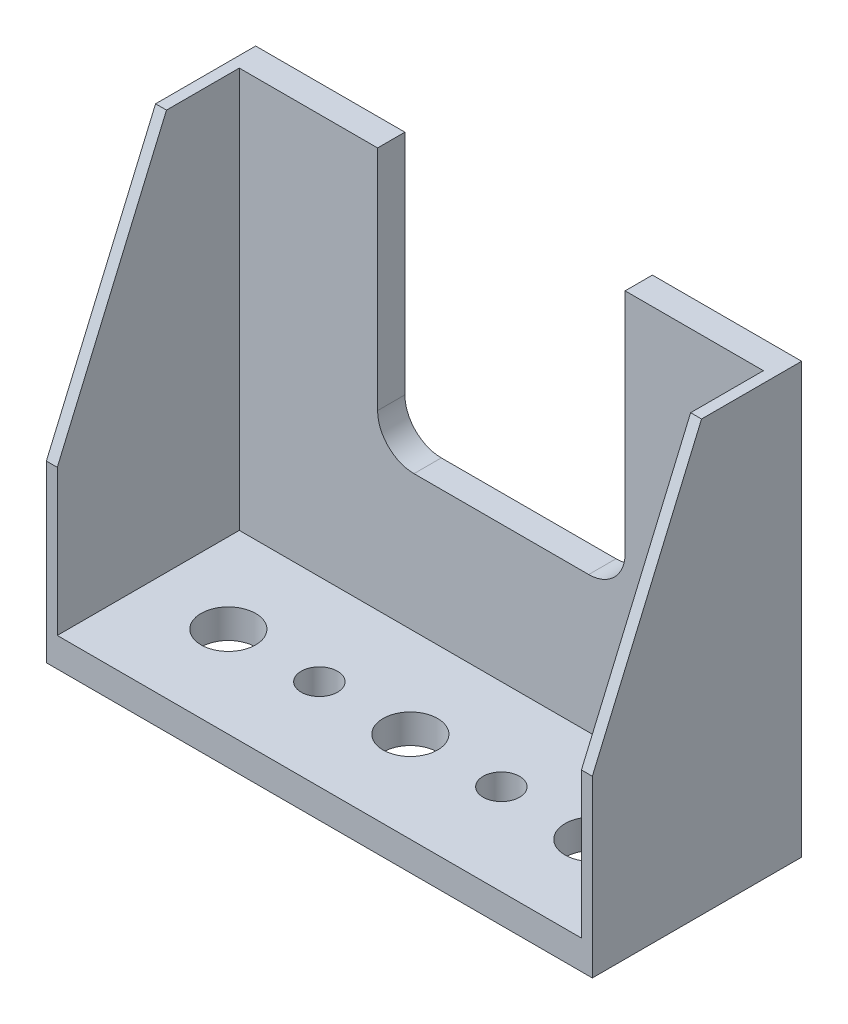
ISO-10303-21;
HEADER;
FILE_DESCRIPTION(('STEP AP214'),'2;1');
FILE_NAME('part.step','',(''),(''),'','','');
FILE_SCHEMA(('AUTOMOTIVE_DESIGN { 1 0 10303 214 1 1 1 1 }'));
ENDSEC;
DATA;
#1=APPLICATION_CONTEXT('core data for automotive mechanical design processes');
#2=APPLICATION_PROTOCOL_DEFINITION('international standard','automotive_design',2000,#1);
#3=PRODUCT_CONTEXT('',#1,'mechanical');
#4=PRODUCT('Part','Part','',(#3));
#5=PRODUCT_RELATED_PRODUCT_CATEGORY('part','',(#4));
#6=PRODUCT_DEFINITION_FORMATION('','',#4);
#7=PRODUCT_DEFINITION_CONTEXT('part definition',#1,'design');
#8=PRODUCT_DEFINITION('design','',#6,#7);
#9=PRODUCT_DEFINITION_SHAPE('','',#8);
#10=(LENGTH_UNIT() NAMED_UNIT(*) SI_UNIT(.MILLI.,.METRE.));
#11=(NAMED_UNIT(*) PLANE_ANGLE_UNIT() SI_UNIT($,.RADIAN.));
#12=(NAMED_UNIT(*) SI_UNIT($,.STERADIAN.) SOLID_ANGLE_UNIT());
#13=UNCERTAINTY_MEASURE_WITH_UNIT(LENGTH_MEASURE(1.E-05),#10,'distance_accuracy_value','');
#14=(GEOMETRIC_REPRESENTATION_CONTEXT(3) GLOBAL_UNCERTAINTY_ASSIGNED_CONTEXT((#13)) GLOBAL_UNIT_ASSIGNED_CONTEXT((#10,
#11,#12)) REPRESENTATION_CONTEXT('',''));
#15=CARTESIAN_POINT('',(0.,0.,0.));
#16=DIRECTION('',(0.,0.,1.));
#17=DIRECTION('',(1.,0.,0.));
#18=AXIS2_PLACEMENT_3D('',#15,#16,#17);
#19=CARTESIAN_POINT('',(-15.,11.,1.5));
#20=DIRECTION('',(0.,-1.,0.));
#21=DIRECTION('',(0.,0.,-1.));
#22=AXIS2_PLACEMENT_3D('',#19,#20,#21);
#23=PLANE('',#22);
#24=DIRECTION('',(-1.,0.,0.));
#25=VECTOR('',#24,1.);
#26=CARTESIAN_POINT('',(-15.,11.,1.5));
#27=LINE('',#26,#25);
#28=CARTESIAN_POINT('',(-6.8,11.,1.5));
#29=VERTEX_POINT('',#28);
#30=CARTESIAN_POINT('',(-14.4,11.,1.5));
#31=VERTEX_POINT('',#30);
#32=EDGE_CURVE('E177',#29,#31,#27,.T.);
#33=ORIENTED_EDGE('',*,*,#32,.F.);
#34=DIRECTION('',(0.,0.,1.));
#35=VECTOR('',#34,1.);
#36=CARTESIAN_POINT('',(-6.8,11.,-0.1));
#37=LINE('',#36,#35);
#38=CARTESIAN_POINT('',(-6.8,11.,0.));
#39=VERTEX_POINT('',#38);
#40=EDGE_CURVE('E169',#39,#29,#37,.T.);
#41=ORIENTED_EDGE('',*,*,#40,.F.);
#42=DIRECTION('',(-1.,0.,0.));
#43=VECTOR('',#42,1.);
#44=CARTESIAN_POINT('',(-15.,11.,0.));
#45=LINE('',#44,#43);
#46=CARTESIAN_POINT('',(-15.,11.,0.));
#47=VERTEX_POINT('',#46);
#48=EDGE_CURVE('E192',#39,#47,#45,.T.);
#49=ORIENTED_EDGE('',*,*,#48,.T.);
#50=DIRECTION('',(0.,0.,-1.));
#51=VECTOR('',#50,1.);
#52=CARTESIAN_POINT('',(-15.,11.,1.5));
#53=LINE('',#52,#51);
#54=CARTESIAN_POINT('',(-15.,11.,5.5));
#55=VERTEX_POINT('',#54);
#56=EDGE_CURVE('E176',#55,#47,#53,.T.);
#57=ORIENTED_EDGE('',*,*,#56,.F.);
#58=DIRECTION('',(1.,0.,0.));
#59=VECTOR('',#58,1.);
#60=CARTESIAN_POINT('',(-63.6738186810938,11.,5.5));
#61=LINE('',#60,#59);
#62=CARTESIAN_POINT('',(-14.4,11.,5.5));
#63=VERTEX_POINT('',#62);
#64=EDGE_CURVE('E253',#55,#63,#61,.T.);
#65=ORIENTED_EDGE('',*,*,#64,.T.);
#66=DIRECTION('',(0.,0.,-1.));
#67=VECTOR('',#66,1.);
#68=CARTESIAN_POINT('',(-14.4,11.,11.5));
#69=LINE('',#68,#67);
#70=EDGE_CURVE('E280',#63,#31,#69,.T.);
#71=ORIENTED_EDGE('',*,*,#70,.T.);
#72=EDGE_LOOP('',(#33,#41,#49,#57,#65,#71));
#73=FACE_BOUND('',#72,.T.);
#74=ADVANCED_FACE('F38',(#73),#23,.F.);
#75=CARTESIAN_POINT('',(-15.,11.,1.5));
#76=DIRECTION('',(1.,0.,0.));
#77=DIRECTION('',(0.,1.,0.));
#78=AXIS2_PLACEMENT_3D('',#75,#76,#77);
#79=PLANE('',#78);
#80=DIRECTION('',(0.,-0.919145030018058,0.393919298579168));
#81=VECTOR('',#80,1.);
#82=CARTESIAN_POINT('',(-15.,12.448275862069,4.87931034482759));
#83=LINE('',#82,#81);
#84=CARTESIAN_POINT('',(-15.,-3.,11.5));
#85=VERTEX_POINT('',#84);
#86=EDGE_CURVE('E261',#55,#85,#83,.T.);
#87=ORIENTED_EDGE('',*,*,#86,.F.);
#88=ORIENTED_EDGE('',*,*,#56,.T.);
#89=DIRECTION('',(0.,-1.,0.));
#90=VECTOR('',#89,1.);
#91=CARTESIAN_POINT('',(-15.,11.,0.));
#92=LINE('',#91,#90);
#93=CARTESIAN_POINT('',(-15.,-12.6,0.));
#94=VERTEX_POINT('',#93);
#95=EDGE_CURVE('E186',#47,#94,#92,.T.);
#96=ORIENTED_EDGE('',*,*,#95,.T.);
#97=DIRECTION('',(0.,0.,-1.));
#98=VECTOR('',#97,1.);
#99=CARTESIAN_POINT('',(-15.,-12.6,11.5));
#100=LINE('',#99,#98);
#101=CARTESIAN_POINT('',(-15.,-12.6,11.5));
#102=VERTEX_POINT('',#101);
#103=EDGE_CURVE('E235',#102,#94,#100,.T.);
#104=ORIENTED_EDGE('',*,*,#103,.F.);
#105=DIRECTION('',(0.,-1.,0.));
#106=VECTOR('',#105,1.);
#107=CARTESIAN_POINT('',(-15.,11.,11.5));
#108=LINE('',#107,#106);
#109=EDGE_CURVE('E275',#85,#102,#108,.T.);
#110=ORIENTED_EDGE('',*,*,#109,.F.);
#111=EDGE_LOOP('',(#87,#88,#96,#104,#110));
#112=FACE_BOUND('',#111,.T.);
#113=ADVANCED_FACE('F312',(#112),#79,.F.);
#114=CARTESIAN_POINT('',(15.,11.,1.5));
#115=DIRECTION('',(-1.,0.,0.));
#116=DIRECTION('',(0.,-1.,0.));
#117=AXIS2_PLACEMENT_3D('',#114,#115,#116);
#118=PLANE('',#117);
#119=DIRECTION('',(0.,0.919145030018058,-0.393919298579168));
#120=VECTOR('',#119,1.);
#121=CARTESIAN_POINT('',(15.,12.448275862069,4.87931034482759));
#122=LINE('',#121,#120);
#123=CARTESIAN_POINT('',(15.,-2.99999999999999,11.5));
#124=VERTEX_POINT('',#123);
#125=CARTESIAN_POINT('',(15.,11.,5.5));
#126=VERTEX_POINT('',#125);
#127=EDGE_CURVE('E259',#124,#126,#122,.T.);
#128=ORIENTED_EDGE('',*,*,#127,.F.);
#129=DIRECTION('',(0.,-1.,0.));
#130=VECTOR('',#129,1.);
#131=CARTESIAN_POINT('',(15.,11.,11.5));
#132=LINE('',#131,#130);
#133=CARTESIAN_POINT('',(15.,-12.6,11.5));
#134=VERTEX_POINT('',#133);
#135=EDGE_CURVE('E264',#124,#134,#132,.T.);
#136=ORIENTED_EDGE('',*,*,#135,.T.);
#137=DIRECTION('',(0.,0.,1.));
#138=VECTOR('',#137,1.);
#139=CARTESIAN_POINT('',(15.,-12.6,11.5));
#140=LINE('',#139,#138);
#141=CARTESIAN_POINT('',(15.,-12.6,0.));
#142=VERTEX_POINT('',#141);
#143=EDGE_CURVE('E241',#142,#134,#140,.T.);
#144=ORIENTED_EDGE('',*,*,#143,.F.);
#145=DIRECTION('',(0.,1.,0.));
#146=VECTOR('',#145,1.);
#147=CARTESIAN_POINT('',(15.,11.,0.));
#148=LINE('',#147,#146);
#149=CARTESIAN_POINT('',(15.,11.,0.));
#150=VERTEX_POINT('',#149);
#151=EDGE_CURVE('E188',#142,#150,#148,.T.);
#152=ORIENTED_EDGE('',*,*,#151,.T.);
#153=DIRECTION('',(0.,0.,-1.));
#154=VECTOR('',#153,1.);
#155=CARTESIAN_POINT('',(15.,11.,1.5));
#156=LINE('',#155,#154);
#157=EDGE_CURVE('E180',#126,#150,#156,.T.);
#158=ORIENTED_EDGE('',*,*,#157,.F.);
#159=EDGE_LOOP('',(#128,#136,#144,#152,#158));
#160=FACE_BOUND('',#159,.T.);
#161=ADVANCED_FACE('F320',(#160),#118,.F.);
#162=CARTESIAN_POINT('',(-14.4,11.,11.5));
#163=DIRECTION('',(-1.,0.,0.));
#164=DIRECTION('',(0.,-1.,0.));
#165=AXIS2_PLACEMENT_3D('',#162,#163,#164);
#166=PLANE('',#165);
#167=DIRECTION('',(0.,0.919145030018058,-0.393919298579168));
#168=VECTOR('',#167,1.);
#169=CARTESIAN_POINT('',(-14.4,8.82758620689655,6.43103448275862));
#170=LINE('',#169,#168);
#171=CARTESIAN_POINT('',(-14.4,-3.,11.5));
#172=VERTEX_POINT('',#171);
#173=EDGE_CURVE('E256',#172,#63,#170,.T.);
#174=ORIENTED_EDGE('',*,*,#173,.F.);
#175=DIRECTION('',(0.,1.,0.));
#176=VECTOR('',#175,1.);
#177=CARTESIAN_POINT('',(-14.4,11.,11.5));
#178=LINE('',#177,#176);
#179=CARTESIAN_POINT('',(-14.4,-11.,11.5));
#180=VERTEX_POINT('',#179);
#181=EDGE_CURVE('E277',#180,#172,#178,.T.);
#182=ORIENTED_EDGE('',*,*,#181,.F.);
#183=DIRECTION('',(0.,0.,-1.));
#184=VECTOR('',#183,1.);
#185=CARTESIAN_POINT('',(-14.4,-11.,11.5));
#186=LINE('',#185,#184);
#187=CARTESIAN_POINT('',(-14.4,-11.,1.5));
#188=VERTEX_POINT('',#187);
#189=EDGE_CURVE('E189',#180,#188,#186,.T.);
#190=ORIENTED_EDGE('',*,*,#189,.T.);
#191=DIRECTION('',(0.,1.,0.));
#192=VECTOR('',#191,1.);
#193=CARTESIAN_POINT('',(-14.4,11.,1.5));
#194=LINE('',#193,#192);
#195=EDGE_CURVE('E274',#188,#31,#194,.T.);
#196=ORIENTED_EDGE('',*,*,#195,.T.);
#197=ORIENTED_EDGE('',*,*,#70,.F.);
#198=EDGE_LOOP('',(#174,#182,#190,#196,#197));
#199=FACE_BOUND('',#198,.T.);
#200=ADVANCED_FACE('F287',(#199),#166,.F.);
#201=CARTESIAN_POINT('',(14.4,11.,11.5));
#202=DIRECTION('',(-1.,0.,0.));
#203=DIRECTION('',(0.,-1.,0.));
#204=AXIS2_PLACEMENT_3D('',#201,#202,#203);
#205=PLANE('',#204);
#206=DIRECTION('',(0.,1.,0.));
#207=VECTOR('',#206,1.);
#208=CARTESIAN_POINT('',(14.4,11.,11.5));
#209=LINE('',#208,#207);
#210=CARTESIAN_POINT('',(14.4,-11.,11.5));
#211=VERTEX_POINT('',#210);
#212=CARTESIAN_POINT('',(14.4,-3.,11.5));
#213=VERTEX_POINT('',#212);
#214=EDGE_CURVE('E266',#211,#213,#209,.T.);
#215=ORIENTED_EDGE('',*,*,#214,.T.);
#216=DIRECTION('',(0.,0.919145030018058,-0.393919298579168));
#217=VECTOR('',#216,1.);
#218=CARTESIAN_POINT('',(14.4,8.82758620689655,6.43103448275862));
#219=LINE('',#218,#217);
#220=CARTESIAN_POINT('',(14.4,11.,5.5));
#221=VERTEX_POINT('',#220);
#222=EDGE_CURVE('E195',#213,#221,#219,.T.);
#223=ORIENTED_EDGE('',*,*,#222,.T.);
#224=DIRECTION('',(0.,0.,-1.));
#225=VECTOR('',#224,1.);
#226=CARTESIAN_POINT('',(14.4,11.,11.5));
#227=LINE('',#226,#225);
#228=CARTESIAN_POINT('',(14.4,11.,1.5));
#229=VERTEX_POINT('',#228);
#230=EDGE_CURVE('E272',#221,#229,#227,.T.);
#231=ORIENTED_EDGE('',*,*,#230,.T.);
#232=DIRECTION('',(0.,1.,0.));
#233=VECTOR('',#232,1.);
#234=CARTESIAN_POINT('',(14.4,11.,1.5));
#235=LINE('',#234,#233);
#236=CARTESIAN_POINT('',(14.4,-11.,1.5));
#237=VERTEX_POINT('',#236);
#238=EDGE_CURVE('E175',#237,#229,#235,.T.);
#239=ORIENTED_EDGE('',*,*,#238,.F.);
#240=DIRECTION('',(0.,0.,-1.));
#241=VECTOR('',#240,1.);
#242=CARTESIAN_POINT('',(14.4,-11.,11.5));
#243=LINE('',#242,#241);
#244=EDGE_CURVE('E269',#211,#237,#243,.T.);
#245=ORIENTED_EDGE('',*,*,#244,.F.);
#246=EDGE_LOOP('',(#215,#223,#231,#239,#245));
#247=FACE_BOUND('',#246,.T.);
#248=ADVANCED_FACE('F299',(#247),#205,.T.);
#249=CARTESIAN_POINT('',(6.8,11.,0.));
#250=VERTEX_POINT('',#249);
#251=EDGE_CURVE('E168',#150,#250,#45,.T.);
#252=ORIENTED_EDGE('',*,*,#251,.T.);
#253=DIRECTION('',(0.,0.,1.));
#254=VECTOR('',#253,1.);
#255=CARTESIAN_POINT('',(6.8,11.,-0.1));
#256=LINE('',#255,#254);
#257=CARTESIAN_POINT('',(6.8,11.,1.5));
#258=VERTEX_POINT('',#257);
#259=EDGE_CURVE('E155',#250,#258,#256,.T.);
#260=ORIENTED_EDGE('',*,*,#259,.T.);
#261=EDGE_CURVE('E166',#229,#258,#27,.T.);
#262=ORIENTED_EDGE('',*,*,#261,.F.);
#263=ORIENTED_EDGE('',*,*,#230,.F.);
#264=EDGE_CURVE('E247',#221,#126,#61,.T.);
#265=ORIENTED_EDGE('',*,*,#264,.T.);
#266=ORIENTED_EDGE('',*,*,#157,.T.);
#267=EDGE_LOOP('',(#252,#260,#262,#263,#265,#266));
#268=FACE_BOUND('',#267,.T.);
#269=ADVANCED_FACE('F164',(#268),#23,.F.);
#270=CARTESIAN_POINT('',(0.,0.,1.5));
#271=DIRECTION('',(0.,0.,1.));
#272=DIRECTION('',(1.,0.,0.));
#273=AXIS2_PLACEMENT_3D('',#270,#271,#272);
#274=PLANE('',#273);
#275=DIRECTION('',(0.,-1.,0.));
#276=VECTOR('',#275,1.);
#277=CARTESIAN_POINT('',(-6.8,11.,1.5));
#278=LINE('',#277,#276);
#279=CARTESIAN_POINT('',(-6.8,-1.5,1.5));
#280=VERTEX_POINT('',#279);
#281=EDGE_CURVE('E227',#29,#280,#278,.T.);
#282=ORIENTED_EDGE('',*,*,#281,.F.);
#283=ORIENTED_EDGE('',*,*,#32,.T.);
#284=ORIENTED_EDGE('',*,*,#195,.F.);
#285=DIRECTION('',(1.,0.,0.));
#286=VECTOR('',#285,1.);
#287=CARTESIAN_POINT('',(-15.,-11.,1.5));
#288=LINE('',#287,#286);
#289=EDGE_CURVE('E182',#188,#237,#288,.T.);
#290=ORIENTED_EDGE('',*,*,#289,.T.);
#291=ORIENTED_EDGE('',*,*,#238,.T.);
#292=ORIENTED_EDGE('',*,*,#261,.T.);
#293=DIRECTION('',(0.,1.,0.));
#294=VECTOR('',#293,1.);
#295=CARTESIAN_POINT('',(6.8,11.,1.5));
#296=LINE('',#295,#294);
#297=CARTESIAN_POINT('',(6.8,-1.5,1.5));
#298=VERTEX_POINT('',#297);
#299=EDGE_CURVE('E151',#298,#258,#296,.T.);
#300=ORIENTED_EDGE('',*,*,#299,.F.);
#301=CARTESIAN_POINT('',(4.8,-1.5,1.5));
#302=DIRECTION('',(0.,0.,1.));
#303=DIRECTION('',(1.,0.,0.));
#304=AXIS2_PLACEMENT_3D('',#301,#302,#303);
#305=CIRCLE('',#304,2.);
#306=CARTESIAN_POINT('',(4.8,-3.5,1.5));
#307=VERTEX_POINT('',#306);
#308=EDGE_CURVE('E212',#298,#307,#305,.F.);
#309=ORIENTED_EDGE('',*,*,#308,.T.);
#310=DIRECTION('',(1.,0.,0.));
#311=VECTOR('',#310,1.);
#312=CARTESIAN_POINT('',(-6.8,-3.5,1.5));
#313=LINE('',#312,#311);
#314=CARTESIAN_POINT('',(-4.8,-3.5,1.5));
#315=VERTEX_POINT('',#314);
#316=EDGE_CURVE('E160',#315,#307,#313,.T.);
#317=ORIENTED_EDGE('',*,*,#316,.F.);
#318=CARTESIAN_POINT('',(-4.8,-1.5,1.5));
#319=DIRECTION('',(0.,0.,1.));
#320=DIRECTION('',(1.,0.,0.));
#321=AXIS2_PLACEMENT_3D('',#318,#319,#320);
#322=CIRCLE('',#321,2.);
#323=EDGE_CURVE('E46',#315,#280,#322,.F.);
#324=ORIENTED_EDGE('',*,*,#323,.T.);
#325=EDGE_LOOP('',(#282,#283,#284,#290,#291,#292,#300,#309,#317,#324));
#326=FACE_BOUND('',#325,.T.);
#327=ADVANCED_FACE('F172',(#326),#274,.T.);
#328=CARTESIAN_POINT('',(0.,0.,0.));
#329=DIRECTION('',(0.,0.,1.));
#330=DIRECTION('',(1.,0.,0.));
#331=AXIS2_PLACEMENT_3D('',#328,#329,#330);
#332=PLANE('',#331);
#333=ORIENTED_EDGE('',*,*,#48,.F.);
#334=DIRECTION('',(0.,-1.,0.));
#335=VECTOR('',#334,1.);
#336=CARTESIAN_POINT('',(-6.8,0.,0.));
#337=LINE('',#336,#335);
#338=CARTESIAN_POINT('',(-6.8,-1.5,0.));
#339=VERTEX_POINT('',#338);
#340=EDGE_CURVE('E203',#39,#339,#337,.T.);
#341=ORIENTED_EDGE('',*,*,#340,.T.);
#342=CARTESIAN_POINT('',(-4.8,-1.5,0.));
#343=DIRECTION('',(0.,0.,1.));
#344=DIRECTION('',(1.,0.,0.));
#345=AXIS2_PLACEMENT_3D('',#342,#343,#344);
#346=CIRCLE('',#345,2.);
#347=CARTESIAN_POINT('',(-4.8,-3.5,0.));
#348=VERTEX_POINT('',#347);
#349=EDGE_CURVE('E11',#339,#348,#346,.T.);
#350=ORIENTED_EDGE('',*,*,#349,.T.);
#351=DIRECTION('',(1.,0.,0.));
#352=VECTOR('',#351,1.);
#353=CARTESIAN_POINT('',(0.,-3.5,0.));
#354=LINE('',#353,#352);
#355=CARTESIAN_POINT('',(4.8,-3.5,0.));
#356=VERTEX_POINT('',#355);
#357=EDGE_CURVE('E198',#348,#356,#354,.T.);
#358=ORIENTED_EDGE('',*,*,#357,.T.);
#359=CARTESIAN_POINT('',(4.8,-1.5,0.));
#360=DIRECTION('',(0.,0.,1.));
#361=DIRECTION('',(1.,0.,0.));
#362=AXIS2_PLACEMENT_3D('',#359,#360,#361);
#363=CIRCLE('',#362,2.);
#364=CARTESIAN_POINT('',(6.8,-1.5,0.));
#365=VERTEX_POINT('',#364);
#366=EDGE_CURVE('E214',#356,#365,#363,.T.);
#367=ORIENTED_EDGE('',*,*,#366,.T.);
#368=DIRECTION('',(0.,1.,0.));
#369=VECTOR('',#368,1.);
#370=CARTESIAN_POINT('',(6.8,0.,0.));
#371=LINE('',#370,#369);
#372=EDGE_CURVE('E201',#365,#250,#371,.T.);
#373=ORIENTED_EDGE('',*,*,#372,.T.);
#374=ORIENTED_EDGE('',*,*,#251,.F.);
#375=ORIENTED_EDGE('',*,*,#151,.F.);
#376=DIRECTION('',(1.,0.,0.));
#377=VECTOR('',#376,1.);
#378=CARTESIAN_POINT('',(-15.,-12.6,0.));
#379=LINE('',#378,#377);
#380=EDGE_CURVE('E238',#94,#142,#379,.T.);
#381=ORIENTED_EDGE('',*,*,#380,.F.);
#382=ORIENTED_EDGE('',*,*,#95,.F.);
#383=EDGE_LOOP('',(#333,#341,#350,#358,#367,#373,#374,#375,#381,#382));
#384=FACE_BOUND('',#383,.T.);
#385=ADVANCED_FACE('F218',(#384),#332,.F.);
#386=CARTESIAN_POINT('',(0.,0.,11.5));
#387=DIRECTION('',(0.,0.,1.));
#388=DIRECTION('',(1.,0.,0.));
#389=AXIS2_PLACEMENT_3D('',#386,#387,#388);
#390=PLANE('',#389);
#391=DIRECTION('',(1.,0.,0.));
#392=VECTOR('',#391,1.);
#393=CARTESIAN_POINT('',(-63.6738186810938,-3.00000000000001,11.5));
#394=LINE('',#393,#392);
#395=EDGE_CURVE('E252',#85,#172,#394,.T.);
#396=ORIENTED_EDGE('',*,*,#395,.F.);
#397=ORIENTED_EDGE('',*,*,#109,.T.);
#398=DIRECTION('',(-1.,0.,0.));
#399=VECTOR('',#398,1.);
#400=CARTESIAN_POINT('',(-15.,-12.6,11.5));
#401=LINE('',#400,#399);
#402=EDGE_CURVE('E244',#134,#102,#401,.T.);
#403=ORIENTED_EDGE('',*,*,#402,.F.);
#404=ORIENTED_EDGE('',*,*,#135,.F.);
#405=EDGE_CURVE('E250',#213,#124,#394,.T.);
#406=ORIENTED_EDGE('',*,*,#405,.F.);
#407=ORIENTED_EDGE('',*,*,#214,.F.);
#408=DIRECTION('',(-1.,0.,0.));
#409=VECTOR('',#408,1.);
#410=CARTESIAN_POINT('',(-15.,-11.,11.5));
#411=LINE('',#410,#409);
#412=EDGE_CURVE('E233',#211,#180,#411,.T.);
#413=ORIENTED_EDGE('',*,*,#412,.T.);
#414=ORIENTED_EDGE('',*,*,#181,.T.);
#415=EDGE_LOOP('',(#396,#397,#403,#404,#406,#407,#413,#414));
#416=FACE_BOUND('',#415,.T.);
#417=ADVANCED_FACE('F294',(#416),#390,.T.);
#418=CARTESIAN_POINT('',(-63.6738186810938,11.,5.5));
#419=DIRECTION('',(0.,0.393919298579168,0.919145030018058));
#420=DIRECTION('',(0.,-0.919145030018058,0.393919298579168));
#421=AXIS2_PLACEMENT_3D('',#418,#419,#420);
#422=PLANE('',#421);
#423=ORIENTED_EDGE('',*,*,#405,.T.);
#424=ORIENTED_EDGE('',*,*,#127,.T.);
#425=ORIENTED_EDGE('',*,*,#264,.F.);
#426=ORIENTED_EDGE('',*,*,#222,.F.);
#427=EDGE_LOOP('',(#423,#424,#425,#426));
#428=FACE_BOUND('',#427,.T.);
#429=ADVANCED_FACE('F323',(#428),#422,.T.);
#430=ORIENTED_EDGE('',*,*,#64,.F.);
#431=ORIENTED_EDGE('',*,*,#86,.T.);
#432=ORIENTED_EDGE('',*,*,#395,.T.);
#433=ORIENTED_EDGE('',*,*,#173,.T.);
#434=EDGE_LOOP('',(#430,#431,#432,#433));
#435=FACE_BOUND('',#434,.T.);
#436=ADVANCED_FACE('F307',(#435),#422,.T.);
#437=CARTESIAN_POINT('',(0.,-11.,0.));
#438=DIRECTION('',(0.,-1.,0.));
#439=DIRECTION('',(0.,0.,-1.));
#440=AXIS2_PLACEMENT_3D('',#437,#438,#439);
#441=PLANE('',#440);
#442=CARTESIAN_POINT('',(10.,-11.,6.5));
#443=DIRECTION('',(0.,1.,0.));
#444=DIRECTION('',(0.,0.,1.));
#445=AXIS2_PLACEMENT_3D('',#442,#443,#444);
#446=CIRCLE('',#445,1.5);
#447=CARTESIAN_POINT('',(10.,-11.,8.));
#448=VERTEX_POINT('',#447);
#449=EDGE_CURVE('E486',#448,#448,#446,.T.);
#450=ORIENTED_EDGE('',*,*,#449,.F.);
#451=EDGE_LOOP('',(#450));
#452=FACE_BOUND('',#451,.T.);
#453=CARTESIAN_POINT('',(5.,-11.,6.5));
#454=DIRECTION('',(0.,1.,0.));
#455=DIRECTION('',(0.,0.,1.));
#456=AXIS2_PLACEMENT_3D('',#453,#454,#455);
#457=CIRCLE('',#456,1.);
#458=CARTESIAN_POINT('',(5.,-11.,7.5));
#459=VERTEX_POINT('',#458);
#460=EDGE_CURVE('E490',#459,#459,#457,.T.);
#461=ORIENTED_EDGE('',*,*,#460,.F.);
#462=EDGE_LOOP('',(#461));
#463=FACE_BOUND('',#462,.T.);
#464=CARTESIAN_POINT('',(-10.,-11.,6.5));
#465=DIRECTION('',(0.,1.,0.));
#466=DIRECTION('',(0.,0.,1.));
#467=AXIS2_PLACEMENT_3D('',#464,#465,#466);
#468=CIRCLE('',#467,1.5);
#469=CARTESIAN_POINT('',(-10.,-11.,8.));
#470=VERTEX_POINT('',#469);
#471=EDGE_CURVE('E507',#470,#470,#468,.T.);
#472=ORIENTED_EDGE('',*,*,#471,.F.);
#473=EDGE_LOOP('',(#472));
#474=FACE_BOUND('',#473,.T.);
#475=CARTESIAN_POINT('',(-5.,-11.,6.5));
#476=DIRECTION('',(0.,1.,0.));
#477=DIRECTION('',(0.,0.,1.));
#478=AXIS2_PLACEMENT_3D('',#475,#476,#477);
#479=CIRCLE('',#478,1.);
#480=CARTESIAN_POINT('',(-5.,-11.,7.5));
#481=VERTEX_POINT('',#480);
#482=EDGE_CURVE('E498',#481,#481,#479,.T.);
#483=ORIENTED_EDGE('',*,*,#482,.F.);
#484=EDGE_LOOP('',(#483));
#485=FACE_BOUND('',#484,.T.);
#486=CARTESIAN_POINT('',(0.,-11.,6.5));
#487=DIRECTION('',(0.,1.,0.));
#488=DIRECTION('',(0.,0.,1.));
#489=AXIS2_PLACEMENT_3D('',#486,#487,#488);
#490=CIRCLE('',#489,1.5);
#491=CARTESIAN_POINT('',(0.,-11.,8.));
#492=VERTEX_POINT('',#491);
#493=EDGE_CURVE('E496',#492,#492,#490,.T.);
#494=ORIENTED_EDGE('',*,*,#493,.F.);
#495=EDGE_LOOP('',(#494));
#496=FACE_BOUND('',#495,.T.);
#497=ORIENTED_EDGE('',*,*,#412,.F.);
#498=ORIENTED_EDGE('',*,*,#244,.T.);
#499=ORIENTED_EDGE('',*,*,#289,.F.);
#500=ORIENTED_EDGE('',*,*,#189,.F.);
#501=EDGE_LOOP('',(#497,#498,#499,#500));
#502=FACE_BOUND('',#501,.T.);
#503=ADVANCED_FACE('F290',(#452,#463,#474,#485,#496,#502),#441,.F.);
#504=CARTESIAN_POINT('',(0.,-12.6,0.));
#505=DIRECTION('',(0.,-1.,0.));
#506=DIRECTION('',(0.,0.,-1.));
#507=AXIS2_PLACEMENT_3D('',#504,#505,#506);
#508=PLANE('',#507);
#509=CARTESIAN_POINT('',(10.,-12.6,6.5));
#510=DIRECTION('',(0.,1.,0.));
#511=DIRECTION('',(0.,0.,1.));
#512=AXIS2_PLACEMENT_3D('',#509,#510,#511);
#513=CIRCLE('',#512,1.5);
#514=CARTESIAN_POINT('',(10.,-12.6,8.));
#515=VERTEX_POINT('',#514);
#516=EDGE_CURVE('E483',#515,#515,#513,.T.);
#517=ORIENTED_EDGE('',*,*,#516,.T.);
#518=EDGE_LOOP('',(#517));
#519=FACE_BOUND('',#518,.T.);
#520=CARTESIAN_POINT('',(5.,-12.6,6.5));
#521=DIRECTION('',(0.,1.,0.));
#522=DIRECTION('',(0.,0.,1.));
#523=AXIS2_PLACEMENT_3D('',#520,#521,#522);
#524=CIRCLE('',#523,1.);
#525=CARTESIAN_POINT('',(5.,-12.6,7.5));
#526=VERTEX_POINT('',#525);
#527=EDGE_CURVE('E487',#526,#526,#524,.T.);
#528=ORIENTED_EDGE('',*,*,#527,.T.);
#529=EDGE_LOOP('',(#528));
#530=FACE_BOUND('',#529,.T.);
#531=CARTESIAN_POINT('',(-10.,-12.6,6.5));
#532=DIRECTION('',(0.,1.,0.));
#533=DIRECTION('',(0.,0.,1.));
#534=AXIS2_PLACEMENT_3D('',#531,#532,#533);
#535=CIRCLE('',#534,1.5);
#536=CARTESIAN_POINT('',(-10.,-12.6,8.));
#537=VERTEX_POINT('',#536);
#538=EDGE_CURVE('E512',#537,#537,#535,.T.);
#539=ORIENTED_EDGE('',*,*,#538,.T.);
#540=EDGE_LOOP('',(#539));
#541=FACE_BOUND('',#540,.T.);
#542=CARTESIAN_POINT('',(-5.,-12.6,6.5));
#543=DIRECTION('',(0.,1.,0.));
#544=DIRECTION('',(0.,0.,1.));
#545=AXIS2_PLACEMENT_3D('',#542,#543,#544);
#546=CIRCLE('',#545,1.);
#547=CARTESIAN_POINT('',(-5.,-12.6,7.5));
#548=VERTEX_POINT('',#547);
#549=EDGE_CURVE('E502',#548,#548,#546,.T.);
#550=ORIENTED_EDGE('',*,*,#549,.T.);
#551=EDGE_LOOP('',(#550));
#552=FACE_BOUND('',#551,.T.);
#553=CARTESIAN_POINT('',(0.,-12.6,6.5));
#554=DIRECTION('',(0.,1.,0.));
#555=DIRECTION('',(0.,0.,1.));
#556=AXIS2_PLACEMENT_3D('',#553,#554,#555);
#557=CIRCLE('',#556,1.5);
#558=CARTESIAN_POINT('',(0.,-12.6,8.));
#559=VERTEX_POINT('',#558);
#560=EDGE_CURVE('E229',#559,#559,#557,.T.);
#561=ORIENTED_EDGE('',*,*,#560,.T.);
#562=EDGE_LOOP('',(#561));
#563=FACE_BOUND('',#562,.T.);
#564=ORIENTED_EDGE('',*,*,#103,.T.);
#565=ORIENTED_EDGE('',*,*,#380,.T.);
#566=ORIENTED_EDGE('',*,*,#143,.T.);
#567=ORIENTED_EDGE('',*,*,#402,.T.);
#568=EDGE_LOOP('',(#564,#565,#566,#567));
#569=FACE_BOUND('',#568,.T.);
#570=ADVANCED_FACE('F316',(#519,#530,#541,#552,#563,#569),#508,.T.);
#571=CARTESIAN_POINT('',(-6.8,11.,-0.1));
#572=DIRECTION('',(-1.,0.,0.));
#573=DIRECTION('',(0.,-1.,0.));
#574=AXIS2_PLACEMENT_3D('',#571,#572,#573);
#575=PLANE('',#574);
#576=ORIENTED_EDGE('',*,*,#281,.T.);
#577=DIRECTION('',(0.,0.,1.));
#578=VECTOR('',#577,1.);
#579=CARTESIAN_POINT('',(-6.8,-1.5,0.));
#580=LINE('',#579,#578);
#581=EDGE_CURVE('E53',#280,#339,#580,.F.);
#582=ORIENTED_EDGE('',*,*,#581,.T.);
#583=ORIENTED_EDGE('',*,*,#340,.F.);
#584=ORIENTED_EDGE('',*,*,#40,.T.);
#585=EDGE_LOOP('',(#576,#582,#583,#584));
#586=FACE_BOUND('',#585,.T.);
#587=ADVANCED_FACE('F325',(#586),#575,.F.);
#588=CARTESIAN_POINT('',(6.8,11.,-0.1));
#589=DIRECTION('',(1.,0.,0.));
#590=DIRECTION('',(0.,1.,0.));
#591=AXIS2_PLACEMENT_3D('',#588,#589,#590);
#592=PLANE('',#591);
#593=ORIENTED_EDGE('',*,*,#372,.F.);
#594=DIRECTION('',(0.,0.,1.));
#595=VECTOR('',#594,1.);
#596=CARTESIAN_POINT('',(6.8,-1.5,1.5));
#597=LINE('',#596,#595);
#598=EDGE_CURVE('E158',#365,#298,#597,.T.);
#599=ORIENTED_EDGE('',*,*,#598,.T.);
#600=ORIENTED_EDGE('',*,*,#299,.T.);
#601=ORIENTED_EDGE('',*,*,#259,.F.);
#602=EDGE_LOOP('',(#593,#599,#600,#601));
#603=FACE_BOUND('',#602,.T.);
#604=ADVANCED_FACE('F154',(#603),#592,.F.);
#605=CARTESIAN_POINT('',(-6.8,-3.5,-0.1));
#606=DIRECTION('',(0.,-1.,0.));
#607=DIRECTION('',(0.,0.,-1.));
#608=AXIS2_PLACEMENT_3D('',#605,#606,#607);
#609=PLANE('',#608);
#610=ORIENTED_EDGE('',*,*,#316,.T.);
#611=DIRECTION('',(0.,0.,1.));
#612=VECTOR('',#611,1.);
#613=CARTESIAN_POINT('',(4.8,-3.5,0.));
#614=LINE('',#613,#612);
#615=EDGE_CURVE('E209',#307,#356,#614,.F.);
#616=ORIENTED_EDGE('',*,*,#615,.T.);
#617=ORIENTED_EDGE('',*,*,#357,.F.);
#618=DIRECTION('',(0.,0.,1.));
#619=VECTOR('',#618,1.);
#620=CARTESIAN_POINT('',(-4.8,-3.5,1.5));
#621=LINE('',#620,#619);
#622=EDGE_CURVE('E206',#348,#315,#621,.T.);
#623=ORIENTED_EDGE('',*,*,#622,.T.);
#624=EDGE_LOOP('',(#610,#616,#617,#623));
#625=FACE_BOUND('',#624,.T.);
#626=ADVANCED_FACE('F225',(#625),#609,.F.);
#627=CARTESIAN_POINT('',(4.8,-1.5,-0.1));
#628=DIRECTION('',(0.,0.,-1.));
#629=DIRECTION('',(-1.,0.,0.));
#630=AXIS2_PLACEMENT_3D('',#627,#628,#629);
#631=CYLINDRICAL_SURFACE('',#630,2.);
#632=ORIENTED_EDGE('',*,*,#366,.F.);
#633=ORIENTED_EDGE('',*,*,#615,.F.);
#634=ORIENTED_EDGE('',*,*,#308,.F.);
#635=ORIENTED_EDGE('',*,*,#598,.F.);
#636=EDGE_LOOP('',(#632,#633,#634,#635));
#637=FACE_BOUND('',#636,.T.);
#638=ADVANCED_FACE('F222',(#637),#631,.F.);
#639=CARTESIAN_POINT('',(-4.8,-1.5,-0.1));
#640=DIRECTION('',(0.,0.,-1.));
#641=DIRECTION('',(-1.,0.,0.));
#642=AXIS2_PLACEMENT_3D('',#639,#640,#641);
#643=CYLINDRICAL_SURFACE('',#642,2.);
#644=ORIENTED_EDGE('',*,*,#349,.F.);
#645=ORIENTED_EDGE('',*,*,#581,.F.);
#646=ORIENTED_EDGE('',*,*,#323,.F.);
#647=ORIENTED_EDGE('',*,*,#622,.F.);
#648=EDGE_LOOP('',(#644,#645,#646,#647));
#649=FACE_BOUND('',#648,.T.);
#650=ADVANCED_FACE('F40',(#649),#643,.F.);
#651=CARTESIAN_POINT('',(0.,-12.6,6.5));
#652=DIRECTION('',(0.,1.,0.));
#653=DIRECTION('',(0.,0.,1.));
#654=AXIS2_PLACEMENT_3D('',#651,#652,#653);
#655=CYLINDRICAL_SURFACE('',#654,1.5);
#656=ORIENTED_EDGE('',*,*,#560,.F.);
#657=EDGE_LOOP('',(#656));
#658=FACE_BOUND('',#657,.T.);
#659=ORIENTED_EDGE('',*,*,#493,.T.);
#660=EDGE_LOOP('',(#659));
#661=FACE_BOUND('',#660,.T.);
#662=ADVANCED_FACE('F328',(#658,#661),#655,.F.);
#663=CARTESIAN_POINT('',(-5.,-12.6,6.5));
#664=DIRECTION('',(0.,1.,0.));
#665=DIRECTION('',(0.,0.,1.));
#666=AXIS2_PLACEMENT_3D('',#663,#664,#665);
#667=CYLINDRICAL_SURFACE('',#666,1.);
#668=ORIENTED_EDGE('',*,*,#549,.F.);
#669=EDGE_LOOP('',(#668));
#670=FACE_BOUND('',#669,.T.);
#671=ORIENTED_EDGE('',*,*,#482,.T.);
#672=EDGE_LOOP('',(#671));
#673=FACE_BOUND('',#672,.T.);
#674=ADVANCED_FACE('F333',(#670,#673),#667,.F.);
#675=CARTESIAN_POINT('',(-10.,-12.6,6.5));
#676=DIRECTION('',(0.,1.,0.));
#677=DIRECTION('',(0.,0.,1.));
#678=AXIS2_PLACEMENT_3D('',#675,#676,#677);
#679=CYLINDRICAL_SURFACE('',#678,1.5);
#680=ORIENTED_EDGE('',*,*,#538,.F.);
#681=EDGE_LOOP('',(#680));
#682=FACE_BOUND('',#681,.T.);
#683=ORIENTED_EDGE('',*,*,#471,.T.);
#684=EDGE_LOOP('',(#683));
#685=FACE_BOUND('',#684,.T.);
#686=ADVANCED_FACE('F439',(#682,#685),#679,.F.);
#687=CARTESIAN_POINT('',(5.,-12.6,6.5));
#688=DIRECTION('',(0.,1.,0.));
#689=DIRECTION('',(0.,0.,1.));
#690=AXIS2_PLACEMENT_3D('',#687,#688,#689);
#691=CYLINDRICAL_SURFACE('',#690,1.);
#692=ORIENTED_EDGE('',*,*,#527,.F.);
#693=EDGE_LOOP('',(#692));
#694=FACE_BOUND('',#693,.T.);
#695=ORIENTED_EDGE('',*,*,#460,.T.);
#696=EDGE_LOOP('',(#695));
#697=FACE_BOUND('',#696,.T.);
#698=ADVANCED_FACE('F450',(#694,#697),#691,.F.);
#699=CARTESIAN_POINT('',(10.,-12.6,6.5));
#700=DIRECTION('',(0.,1.,0.));
#701=DIRECTION('',(0.,0.,1.));
#702=AXIS2_PLACEMENT_3D('',#699,#700,#701);
#703=CYLINDRICAL_SURFACE('',#702,1.5);
#704=ORIENTED_EDGE('',*,*,#516,.F.);
#705=EDGE_LOOP('',(#704));
#706=FACE_BOUND('',#705,.T.);
#707=ORIENTED_EDGE('',*,*,#449,.T.);
#708=EDGE_LOOP('',(#707));
#709=FACE_BOUND('',#708,.T.);
#710=ADVANCED_FACE('F461',(#706,#709),#703,.F.);
#711=CLOSED_SHELL('',(#74,#113,#161,#200,#248,#269,#327,#385,#417,#429,#436,#503,#570,#587,#604,
#626,#638,#650,#662,#674,#686,#698,#710));
#712=MANIFOLD_SOLID_BREP('B2',#711);
#713=ADVANCED_BREP_SHAPE_REPRESENTATION('',(#18,#712),#14);
#714=SHAPE_DEFINITION_REPRESENTATION(#9,#713);
ENDSEC;
END-ISO-10303-21;
